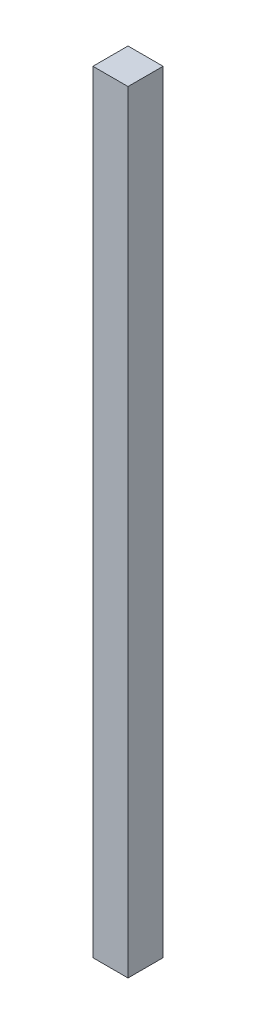
ISO-10303-21;
HEADER;
FILE_DESCRIPTION(('STEP AP214'),'2;1');
FILE_NAME('part.step','',(''),(''),'','','');
FILE_SCHEMA(('AUTOMOTIVE_DESIGN { 1 0 10303 214 1 1 1 1 }'));
ENDSEC;
DATA;
#1=APPLICATION_CONTEXT('core data for automotive mechanical design processes');
#2=APPLICATION_PROTOCOL_DEFINITION('international standard','automotive_design',2000,#1);
#3=PRODUCT_CONTEXT('',#1,'mechanical');
#4=PRODUCT('Part','Part','',(#3));
#5=PRODUCT_RELATED_PRODUCT_CATEGORY('part','',(#4));
#6=PRODUCT_DEFINITION_FORMATION('','',#4);
#7=PRODUCT_DEFINITION_CONTEXT('part definition',#1,'design');
#8=PRODUCT_DEFINITION('design','',#6,#7);
#9=PRODUCT_DEFINITION_SHAPE('','',#8);
#10=(LENGTH_UNIT() NAMED_UNIT(*) SI_UNIT(.MILLI.,.METRE.));
#11=(NAMED_UNIT(*) PLANE_ANGLE_UNIT() SI_UNIT($,.RADIAN.));
#12=(NAMED_UNIT(*) SI_UNIT($,.STERADIAN.) SOLID_ANGLE_UNIT());
#13=UNCERTAINTY_MEASURE_WITH_UNIT(LENGTH_MEASURE(1.E-05),#10,'distance_accuracy_value','');
#14=(GEOMETRIC_REPRESENTATION_CONTEXT(3) GLOBAL_UNCERTAINTY_ASSIGNED_CONTEXT((#13)) GLOBAL_UNIT_ASSIGNED_CONTEXT((#10,
#11,#12)) REPRESENTATION_CONTEXT('',''));
#15=CARTESIAN_POINT('',(0.,0.,0.));
#16=DIRECTION('',(0.,0.,1.));
#17=DIRECTION('',(1.,0.,0.));
#18=AXIS2_PLACEMENT_3D('',#15,#16,#17);
#19=CARTESIAN_POINT('',(-41.7324379828111,558.8,-32.1292349242665));
#20=DIRECTION('',(1.,0.,0.));
#21=DIRECTION('',(0.,0.,-1.));
#22=AXIS2_PLACEMENT_3D('',#19,#20,#21);
#23=PLANE('',#22);
#24=DIRECTION('',(0.,0.,1.));
#25=VECTOR('',#24,1.);
#26=CARTESIAN_POINT('',(-41.7324379828111,0.,-32.1292349242665));
#27=LINE('',#26,#25);
#28=CARTESIAN_POINT('',(-41.7324379828111,0.,-32.1292349242665));
#29=VERTEX_POINT('',#28);
#30=CARTESIAN_POINT('',(-41.7324379828111,0.,-6.7292349242665));
#31=VERTEX_POINT('',#30);
#32=EDGE_CURVE('E94',#29,#31,#27,.T.);
#33=ORIENTED_EDGE('',*,*,#32,.T.);
#34=DIRECTION('',(0.,-1.,0.));
#35=VECTOR('',#34,1.);
#36=CARTESIAN_POINT('',(-41.7324379828111,558.8,-6.7292349242665));
#37=LINE('',#36,#35);
#38=CARTESIAN_POINT('',(-41.7324379828111,558.8,-6.7292349242665));
#39=VERTEX_POINT('',#38);
#40=EDGE_CURVE('E11',#39,#31,#37,.T.);
#41=ORIENTED_EDGE('',*,*,#40,.F.);
#42=DIRECTION('',(0.,0.,1.));
#43=VECTOR('',#42,1.);
#44=CARTESIAN_POINT('',(-41.7324379828111,558.8,-32.1292349242665));
#45=LINE('',#44,#43);
#46=CARTESIAN_POINT('',(-41.7324379828111,558.8,-32.1292349242665));
#47=VERTEX_POINT('',#46);
#48=EDGE_CURVE('E82',#47,#39,#45,.T.);
#49=ORIENTED_EDGE('',*,*,#48,.F.);
#50=DIRECTION('',(0.,-1.,0.));
#51=VECTOR('',#50,1.);
#52=CARTESIAN_POINT('',(-41.7324379828111,558.8,-32.1292349242665));
#53=LINE('',#52,#51);
#54=EDGE_CURVE('E90',#47,#29,#53,.T.);
#55=ORIENTED_EDGE('',*,*,#54,.T.);
#56=EDGE_LOOP('',(#33,#41,#49,#55));
#57=FACE_BOUND('',#56,.T.);
#58=ADVANCED_FACE('F31',(#57),#23,.F.);
#59=CARTESIAN_POINT('',(-41.7324379828111,558.8,-6.7292349242665));
#60=DIRECTION('',(0.,0.,-1.));
#61=DIRECTION('',(-1.,0.,0.));
#62=AXIS2_PLACEMENT_3D('',#59,#60,#61);
#63=PLANE('',#62);
#64=DIRECTION('',(1.,0.,0.));
#65=VECTOR('',#64,1.);
#66=CARTESIAN_POINT('',(-41.7324379828111,0.,-6.7292349242665));
#67=LINE('',#66,#65);
#68=CARTESIAN_POINT('',(-16.3324379828111,0.,-6.7292349242665));
#69=VERTEX_POINT('',#68);
#70=EDGE_CURVE('E86',#31,#69,#67,.T.);
#71=ORIENTED_EDGE('',*,*,#70,.T.);
#72=DIRECTION('',(0.,-1.,0.));
#73=VECTOR('',#72,1.);
#74=CARTESIAN_POINT('',(-16.3324379828111,558.8,-6.7292349242665));
#75=LINE('',#74,#73);
#76=CARTESIAN_POINT('',(-16.3324379828111,558.8,-6.7292349242665));
#77=VERTEX_POINT('',#76);
#78=EDGE_CURVE('E39',#77,#69,#75,.T.);
#79=ORIENTED_EDGE('',*,*,#78,.F.);
#80=DIRECTION('',(1.,0.,0.));
#81=VECTOR('',#80,1.);
#82=CARTESIAN_POINT('',(-41.7324379828111,558.8,-6.7292349242665));
#83=LINE('',#82,#81);
#84=EDGE_CURVE('E77',#39,#77,#83,.T.);
#85=ORIENTED_EDGE('',*,*,#84,.F.);
#86=ORIENTED_EDGE('',*,*,#40,.T.);
#87=EDGE_LOOP('',(#71,#79,#85,#86));
#88=FACE_BOUND('',#87,.T.);
#89=ADVANCED_FACE('F85',(#88),#63,.F.);
#90=CARTESIAN_POINT('',(-16.3324379828111,558.8,-32.1292349242665));
#91=DIRECTION('',(-1.,0.,0.));
#92=DIRECTION('',(0.,0.,1.));
#93=AXIS2_PLACEMENT_3D('',#90,#91,#92);
#94=PLANE('',#93);
#95=DIRECTION('',(0.,0.,-1.));
#96=VECTOR('',#95,1.);
#97=CARTESIAN_POINT('',(-16.3324379828111,0.,-32.1292349242665));
#98=LINE('',#97,#96);
#99=CARTESIAN_POINT('',(-16.3324379828111,0.,-32.1292349242665));
#100=VERTEX_POINT('',#99);
#101=EDGE_CURVE('E64',#69,#100,#98,.T.);
#102=ORIENTED_EDGE('',*,*,#101,.T.);
#103=DIRECTION('',(0.,-1.,0.));
#104=VECTOR('',#103,1.);
#105=CARTESIAN_POINT('',(-16.3324379828111,558.8,-32.1292349242665));
#106=LINE('',#105,#104);
#107=CARTESIAN_POINT('',(-16.3324379828111,558.8,-32.1292349242665));
#108=VERTEX_POINT('',#107);
#109=EDGE_CURVE('E87',#108,#100,#106,.T.);
#110=ORIENTED_EDGE('',*,*,#109,.F.);
#111=DIRECTION('',(0.,0.,-1.));
#112=VECTOR('',#111,1.);
#113=CARTESIAN_POINT('',(-16.3324379828111,558.8,-32.1292349242665));
#114=LINE('',#113,#112);
#115=EDGE_CURVE('E80',#77,#108,#114,.T.);
#116=ORIENTED_EDGE('',*,*,#115,.F.);
#117=ORIENTED_EDGE('',*,*,#78,.T.);
#118=EDGE_LOOP('',(#102,#110,#116,#117));
#119=FACE_BOUND('',#118,.T.);
#120=ADVANCED_FACE('F88',(#119),#94,.F.);
#121=CARTESIAN_POINT('',(-41.7324379828111,558.8,-32.1292349242665));
#122=DIRECTION('',(0.,0.,1.));
#123=DIRECTION('',(1.,0.,0.));
#124=AXIS2_PLACEMENT_3D('',#121,#122,#123);
#125=PLANE('',#124);
#126=DIRECTION('',(-1.,0.,0.));
#127=VECTOR('',#126,1.);
#128=CARTESIAN_POINT('',(-41.7324379828111,0.,-32.1292349242665));
#129=LINE('',#128,#127);
#130=EDGE_CURVE('E70',#100,#29,#129,.T.);
#131=ORIENTED_EDGE('',*,*,#130,.T.);
#132=ORIENTED_EDGE('',*,*,#54,.F.);
#133=DIRECTION('',(-1.,0.,0.));
#134=VECTOR('',#133,1.);
#135=CARTESIAN_POINT('',(-41.7324379828111,558.8,-32.1292349242665));
#136=LINE('',#135,#134);
#137=EDGE_CURVE('E47',#108,#47,#136,.T.);
#138=ORIENTED_EDGE('',*,*,#137,.F.);
#139=ORIENTED_EDGE('',*,*,#109,.T.);
#140=EDGE_LOOP('',(#131,#132,#138,#139));
#141=FACE_BOUND('',#140,.T.);
#142=ADVANCED_FACE('F101',(#141),#125,.F.);
#143=CARTESIAN_POINT('',(-41.7324379828111,558.8,-6.7292349242665));
#144=DIRECTION('',(0.,1.,0.));
#145=DIRECTION('',(0.,0.,1.));
#146=AXIS2_PLACEMENT_3D('',#143,#144,#145);
#147=PLANE('',#146);
#148=ORIENTED_EDGE('',*,*,#48,.T.);
#149=ORIENTED_EDGE('',*,*,#84,.T.);
#150=ORIENTED_EDGE('',*,*,#115,.T.);
#151=ORIENTED_EDGE('',*,*,#137,.T.);
#152=EDGE_LOOP('',(#148,#149,#150,#151));
#153=FACE_BOUND('',#152,.T.);
#154=ADVANCED_FACE('F78',(#153),#147,.T.);
#155=CARTESIAN_POINT('',(-41.7324379828111,0.,-6.7292349242665));
#156=DIRECTION('',(0.,1.,0.));
#157=DIRECTION('',(0.,0.,1.));
#158=AXIS2_PLACEMENT_3D('',#155,#156,#157);
#159=PLANE('',#158);
#160=ORIENTED_EDGE('',*,*,#32,.F.);
#161=ORIENTED_EDGE('',*,*,#130,.F.);
#162=ORIENTED_EDGE('',*,*,#101,.F.);
#163=ORIENTED_EDGE('',*,*,#70,.F.);
#164=EDGE_LOOP('',(#160,#161,#162,#163));
#165=FACE_BOUND('',#164,.T.);
#166=ADVANCED_FACE('F104',(#165),#159,.F.);
#167=CLOSED_SHELL('',(#58,#89,#120,#142,#154,#166));
#168=MANIFOLD_SOLID_BREP('B2',#167);
#169=ADVANCED_BREP_SHAPE_REPRESENTATION('',(#18,#168),#14);
#170=SHAPE_DEFINITION_REPRESENTATION(#9,#169);
ENDSEC;
END-ISO-10303-21;
